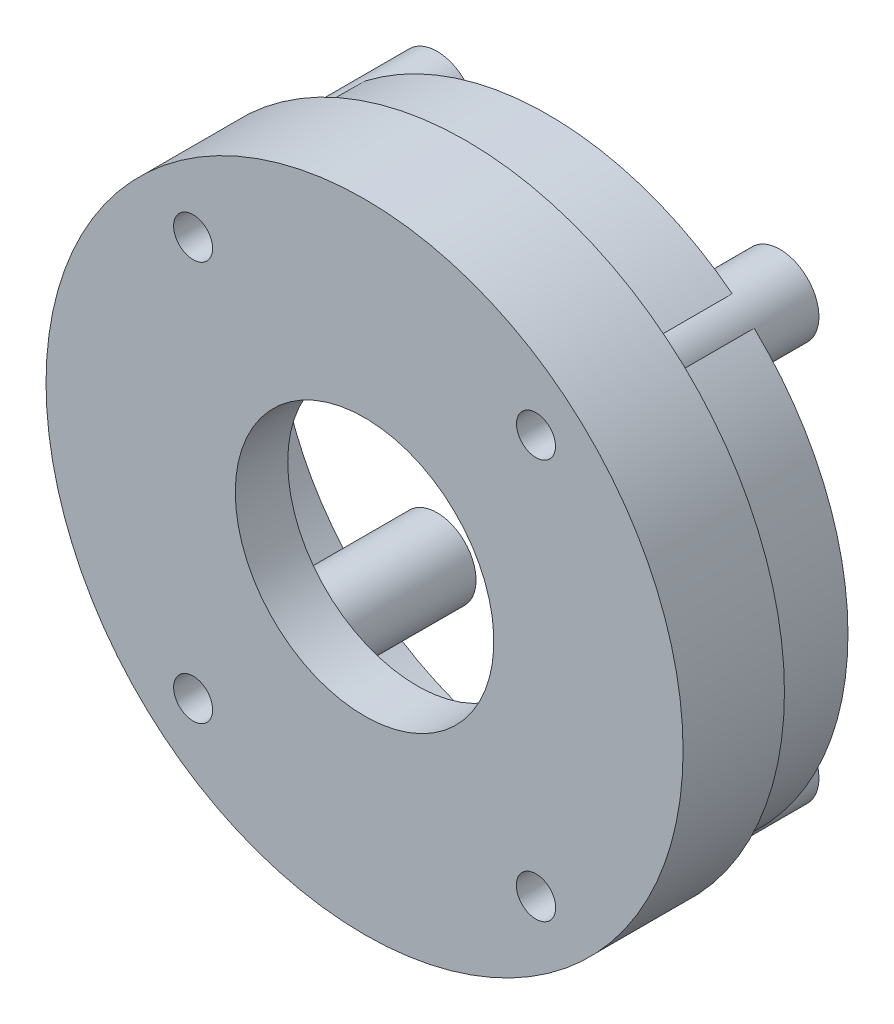
ISO-10303-21;
HEADER;
FILE_DESCRIPTION(('STEP AP214'),'2;1');
FILE_NAME('part.step','',(''),(''),'','','');
FILE_SCHEMA(('AUTOMOTIVE_DESIGN { 1 0 10303 214 1 1 1 1 }'));
ENDSEC;
DATA;
#1=APPLICATION_CONTEXT('core data for automotive mechanical design processes');
#2=APPLICATION_PROTOCOL_DEFINITION('international standard','automotive_design',2000,#1);
#3=PRODUCT_CONTEXT('',#1,'mechanical');
#4=PRODUCT('Part','Part','',(#3));
#5=PRODUCT_RELATED_PRODUCT_CATEGORY('part','',(#4));
#6=PRODUCT_DEFINITION_FORMATION('','',#4);
#7=PRODUCT_DEFINITION_CONTEXT('part definition',#1,'design');
#8=PRODUCT_DEFINITION('design','',#6,#7);
#9=PRODUCT_DEFINITION_SHAPE('','',#8);
#10=(LENGTH_UNIT() NAMED_UNIT(*) SI_UNIT(.MILLI.,.METRE.));
#11=(NAMED_UNIT(*) PLANE_ANGLE_UNIT() SI_UNIT($,.RADIAN.));
#12=(NAMED_UNIT(*) SI_UNIT($,.STERADIAN.) SOLID_ANGLE_UNIT());
#13=UNCERTAINTY_MEASURE_WITH_UNIT(LENGTH_MEASURE(1.E-05),#10,'distance_accuracy_value','');
#14=(GEOMETRIC_REPRESENTATION_CONTEXT(3) GLOBAL_UNCERTAINTY_ASSIGNED_CONTEXT((#13)) GLOBAL_UNIT_ASSIGNED_CONTEXT((#10,
#11,#12)) REPRESENTATION_CONTEXT('',''));
#15=CARTESIAN_POINT('',(0.,0.,0.));
#16=DIRECTION('',(0.,0.,1.));
#17=DIRECTION('',(1.,0.,0.));
#18=AXIS2_PLACEMENT_3D('',#15,#16,#17);
#19=CARTESIAN_POINT('',(0.,0.,-2.705));
#20=DIRECTION('',(0.,0.,1.));
#21=DIRECTION('',(1.,0.,0.));
#22=AXIS2_PLACEMENT_3D('',#19,#20,#21);
#23=PLANE('',#22);
#24=CARTESIAN_POINT('',(0.,0.,-2.705));
#25=DIRECTION('',(0.,0.,1.));
#26=DIRECTION('',(1.,0.,0.));
#27=AXIS2_PLACEMENT_3D('',#24,#25,#26);
#28=CIRCLE('',#27,17.);
#29=CARTESIAN_POINT('',(17.,0.,-2.705));
#30=VERTEX_POINT('',#29);
#31=EDGE_CURVE('E42',#30,#30,#28,.T.);
#32=ORIENTED_EDGE('',*,*,#31,.F.);
#33=EDGE_LOOP('',(#32));
#34=FACE_BOUND('',#33,.T.);
#35=CARTESIAN_POINT('',(9.15,-10.6620823482095,-2.705));
#36=DIRECTION('',(0.,0.,-1.));
#37=DIRECTION('',(-1.,0.,0.));
#38=AXIS2_PLACEMENT_3D('',#35,#36,#37);
#39=CIRCLE('',#38,2.08);
#40=CARTESIAN_POINT('',(10.9937701449825,-11.6248448591494,-2.705));
#41=VERTEX_POINT('',#40);
#42=CARTESIAN_POINT('',(9.82180369526779,-12.6306045845646,-2.705));
#43=VERTEX_POINT('',#42);
#44=EDGE_CURVE('E147',#41,#43,#39,.T.);
#45=ORIENTED_EDGE('',*,*,#44,.F.);
#46=CARTESIAN_POINT('',(0.,0.,-2.705));
#47=DIRECTION('',(0.,0.,-1.));
#48=DIRECTION('',(-1.,0.,0.));
#49=AXIS2_PLACEMENT_3D('',#46,#47,#48);
#50=CIRCLE('',#49,16.);
#51=CARTESIAN_POINT('',(10.9937701449825,11.6248448591494,-2.705));
#52=VERTEX_POINT('',#51);
#53=EDGE_CURVE('E150',#52,#41,#50,.T.);
#54=ORIENTED_EDGE('',*,*,#53,.F.);
#55=CARTESIAN_POINT('',(9.15,10.6620823482095,-2.705));
#56=DIRECTION('',(0.,0.,-1.));
#57=DIRECTION('',(-1.,0.,0.));
#58=AXIS2_PLACEMENT_3D('',#55,#56,#57);
#59=CIRCLE('',#58,2.08);
#60=CARTESIAN_POINT('',(9.82180369526777,12.6306045845646,-2.705));
#61=VERTEX_POINT('',#60);
#62=EDGE_CURVE('E72',#61,#52,#59,.T.);
#63=ORIENTED_EDGE('',*,*,#62,.F.);
#64=CARTESIAN_POINT('',(0.,0.,-2.705));
#65=DIRECTION('',(0.,0.,-1.));
#66=DIRECTION('',(-1.,0.,0.));
#67=AXIS2_PLACEMENT_3D('',#64,#65,#66);
#68=CIRCLE('',#67,16.);
#69=CARTESIAN_POINT('',(-9.82180369526777,12.6306045845646,-2.705));
#70=VERTEX_POINT('',#69);
#71=EDGE_CURVE('E53',#70,#61,#68,.T.);
#72=ORIENTED_EDGE('',*,*,#71,.F.);
#73=CARTESIAN_POINT('',(-9.15,10.6620823482095,-2.705));
#74=DIRECTION('',(0.,0.,-1.));
#75=DIRECTION('',(-1.,0.,0.));
#76=AXIS2_PLACEMENT_3D('',#73,#74,#75);
#77=CIRCLE('',#76,2.08);
#78=CARTESIAN_POINT('',(-10.9937701449825,11.6248448591494,-2.705));
#79=VERTEX_POINT('',#78);
#80=EDGE_CURVE('E466',#79,#70,#77,.T.);
#81=ORIENTED_EDGE('',*,*,#80,.F.);
#82=CARTESIAN_POINT('',(0.,0.,-2.705));
#83=DIRECTION('',(0.,0.,-1.));
#84=DIRECTION('',(-1.,0.,0.));
#85=AXIS2_PLACEMENT_3D('',#82,#83,#84);
#86=CIRCLE('',#85,16.);
#87=CARTESIAN_POINT('',(-10.9937701449825,-11.6248448591494,-2.705));
#88=VERTEX_POINT('',#87);
#89=EDGE_CURVE('E239',#88,#79,#86,.T.);
#90=ORIENTED_EDGE('',*,*,#89,.F.);
#91=CARTESIAN_POINT('',(-9.15,-10.6620823482095,-2.705));
#92=DIRECTION('',(0.,0.,-1.));
#93=DIRECTION('',(-1.,0.,0.));
#94=AXIS2_PLACEMENT_3D('',#91,#92,#93);
#95=CIRCLE('',#94,2.08);
#96=CARTESIAN_POINT('',(-9.82180369526779,-12.6306045845646,-2.705));
#97=VERTEX_POINT('',#96);
#98=EDGE_CURVE('E461',#97,#88,#95,.T.);
#99=ORIENTED_EDGE('',*,*,#98,.F.);
#100=CARTESIAN_POINT('',(0.,0.,-2.705));
#101=DIRECTION('',(0.,0.,-1.));
#102=DIRECTION('',(-1.,0.,0.));
#103=AXIS2_PLACEMENT_3D('',#100,#101,#102);
#104=CIRCLE('',#103,16.);
#105=EDGE_CURVE('E152',#43,#97,#104,.T.);
#106=ORIENTED_EDGE('',*,*,#105,.F.);
#107=EDGE_LOOP('',(#45,#54,#63,#72,#81,#90,#99,#106));
#108=FACE_BOUND('',#107,.T.);
#109=ADVANCED_FACE('F38',(#34,#108),#23,.F.);
#110=CARTESIAN_POINT('',(0.,0.,2.705));
#111=DIRECTION('',(0.,0.,-1.));
#112=DIRECTION('',(-1.,0.,0.));
#113=AXIS2_PLACEMENT_3D('',#110,#111,#112);
#114=CYLINDRICAL_SURFACE('',#113,6.9);
#115=CARTESIAN_POINT('',(0.,0.,2.705));
#116=DIRECTION('',(0.,0.,-1.));
#117=DIRECTION('',(-1.,0.,0.));
#118=AXIS2_PLACEMENT_3D('',#115,#116,#117);
#119=CIRCLE('',#118,6.9);
#120=CARTESIAN_POINT('',(-6.9,0.,2.705));
#121=VERTEX_POINT('',#120);
#122=EDGE_CURVE('E231',#121,#121,#119,.T.);
#123=ORIENTED_EDGE('',*,*,#122,.F.);
#124=EDGE_LOOP('',(#123));
#125=FACE_BOUND('',#124,.T.);
#126=CARTESIAN_POINT('',(0.,0.,-0.095));
#127=DIRECTION('',(0.,0.,-1.));
#128=DIRECTION('',(-1.,0.,0.));
#129=AXIS2_PLACEMENT_3D('',#126,#127,#128);
#130=CIRCLE('',#129,6.9);
#131=CARTESIAN_POINT('',(-6.9,0.,-0.095));
#132=VERTEX_POINT('',#131);
#133=EDGE_CURVE('E497',#132,#132,#130,.T.);
#134=ORIENTED_EDGE('',*,*,#133,.T.);
#135=EDGE_LOOP('',(#134));
#136=FACE_BOUND('',#135,.T.);
#137=ADVANCED_FACE('F142',(#125,#136),#114,.F.);
#138=CARTESIAN_POINT('',(0.,0.,1.405));
#139=DIRECTION('',(0.,0.,-1.));
#140=DIRECTION('',(-1.,0.,0.));
#141=AXIS2_PLACEMENT_3D('',#138,#139,#140);
#142=CYLINDRICAL_SURFACE('',#141,8.14);
#143=CARTESIAN_POINT('',(0.,0.,1.405));
#144=DIRECTION('',(0.,0.,-1.));
#145=DIRECTION('',(-1.,0.,0.));
#146=AXIS2_PLACEMENT_3D('',#143,#144,#145);
#147=CIRCLE('',#146,8.14);
#148=CARTESIAN_POINT('',(-8.14,0.,1.405));
#149=VERTEX_POINT('',#148);
#150=EDGE_CURVE('E228',#149,#149,#147,.T.);
#151=ORIENTED_EDGE('',*,*,#150,.T.);
#152=EDGE_LOOP('',(#151));
#153=FACE_BOUND('',#152,.T.);
#154=CARTESIAN_POINT('',(0.,0.,-0.095));
#155=DIRECTION('',(0.,0.,-1.));
#156=DIRECTION('',(-1.,0.,0.));
#157=AXIS2_PLACEMENT_3D('',#154,#155,#156);
#158=CIRCLE('',#157,8.14);
#159=CARTESIAN_POINT('',(-8.14,0.,-0.095));
#160=VERTEX_POINT('',#159);
#161=EDGE_CURVE('E222',#160,#160,#158,.T.);
#162=ORIENTED_EDGE('',*,*,#161,.F.);
#163=EDGE_LOOP('',(#162));
#164=FACE_BOUND('',#163,.T.);
#165=ADVANCED_FACE('F560',(#153,#164),#142,.T.);
#166=CARTESIAN_POINT('',(0.,0.,2.705));
#167=DIRECTION('',(0.,0.,-1.));
#168=DIRECTION('',(-1.,0.,0.));
#169=AXIS2_PLACEMENT_3D('',#166,#167,#168);
#170=CYLINDRICAL_SURFACE('',#169,17.);
#171=CARTESIAN_POINT('',(0.,0.,2.705));
#172=DIRECTION('',(0.,0.,1.));
#173=DIRECTION('',(1.,0.,0.));
#174=AXIS2_PLACEMENT_3D('',#171,#172,#173);
#175=CIRCLE('',#174,17.);
#176=CARTESIAN_POINT('',(17.,0.,2.705));
#177=VERTEX_POINT('',#176);
#178=EDGE_CURVE('E11',#177,#177,#175,.T.);
#179=ORIENTED_EDGE('',*,*,#178,.F.);
#180=EDGE_LOOP('',(#179));
#181=FACE_BOUND('',#180,.T.);
#182=ORIENTED_EDGE('',*,*,#31,.T.);
#183=EDGE_LOOP('',(#182));
#184=FACE_BOUND('',#183,.T.);
#185=ADVANCED_FACE('F40',(#181,#184),#170,.T.);
#186=CARTESIAN_POINT('',(0.,0.,2.705));
#187=DIRECTION('',(0.,0.,1.));
#188=DIRECTION('',(1.,0.,0.));
#189=AXIS2_PLACEMENT_3D('',#186,#187,#188);
#190=PLANE('',#189);
#191=CARTESIAN_POINT('',(9.15,10.6620823482095,2.705));
#192=DIRECTION('',(0.,0.,-1.));
#193=DIRECTION('',(-1.,0.,0.));
#194=AXIS2_PLACEMENT_3D('',#191,#192,#193);
#195=CIRCLE('',#194,1.04);
#196=CARTESIAN_POINT('',(8.11,10.6620823482095,2.705));
#197=VERTEX_POINT('',#196);
#198=EDGE_CURVE('E484',#197,#197,#195,.T.);
#199=ORIENTED_EDGE('',*,*,#198,.T.);
#200=EDGE_LOOP('',(#199));
#201=FACE_BOUND('',#200,.T.);
#202=CARTESIAN_POINT('',(-9.15,10.6620823482095,2.705));
#203=DIRECTION('',(0.,0.,-1.));
#204=DIRECTION('',(-1.,0.,0.));
#205=AXIS2_PLACEMENT_3D('',#202,#203,#204);
#206=CIRCLE('',#205,1.04);
#207=CARTESIAN_POINT('',(-10.19,10.6620823482095,2.705));
#208=VERTEX_POINT('',#207);
#209=EDGE_CURVE('E490',#208,#208,#206,.T.);
#210=ORIENTED_EDGE('',*,*,#209,.T.);
#211=EDGE_LOOP('',(#210));
#212=FACE_BOUND('',#211,.T.);
#213=CARTESIAN_POINT('',(-9.15,-10.6620823482095,2.705));
#214=DIRECTION('',(0.,0.,-1.));
#215=DIRECTION('',(-1.,0.,0.));
#216=AXIS2_PLACEMENT_3D('',#213,#214,#215);
#217=CIRCLE('',#216,1.04);
#218=CARTESIAN_POINT('',(-10.19,-10.6620823482095,2.705));
#219=VERTEX_POINT('',#218);
#220=EDGE_CURVE('E486',#219,#219,#217,.T.);
#221=ORIENTED_EDGE('',*,*,#220,.T.);
#222=EDGE_LOOP('',(#221));
#223=FACE_BOUND('',#222,.T.);
#224=CARTESIAN_POINT('',(9.15,-10.6620823482095,2.705));
#225=DIRECTION('',(0.,0.,-1.));
#226=DIRECTION('',(-1.,0.,0.));
#227=AXIS2_PLACEMENT_3D('',#224,#225,#226);
#228=CIRCLE('',#227,1.04899770842366);
#229=CARTESIAN_POINT('',(8.10100229157634,-10.6620823482095,2.705));
#230=VERTEX_POINT('',#229);
#231=EDGE_CURVE('E489',#230,#230,#228,.T.);
#232=ORIENTED_EDGE('',*,*,#231,.T.);
#233=EDGE_LOOP('',(#232));
#234=FACE_BOUND('',#233,.T.);
#235=ORIENTED_EDGE('',*,*,#122,.T.);
#236=EDGE_LOOP('',(#235));
#237=FACE_BOUND('',#236,.T.);
#238=ORIENTED_EDGE('',*,*,#178,.T.);
#239=EDGE_LOOP('',(#238));
#240=FACE_BOUND('',#239,.T.);
#241=ADVANCED_FACE('F554',(#201,#212,#223,#234,#237,#240),#190,.T.);
#242=CARTESIAN_POINT('',(0.,0.,-7.095));
#243=DIRECTION('',(0.,0.,1.));
#244=DIRECTION('',(1.,0.,0.));
#245=AXIS2_PLACEMENT_3D('',#242,#243,#244);
#246=CYLINDRICAL_SURFACE('',#245,14.5);
#247=DIRECTION('',(0.,0.,1.));
#248=VECTOR('',#247,1.);
#249=CARTESIAN_POINT('',(7.7859061421898,12.2323205298509,-7.095));
#250=LINE('',#249,#248);
#251=CARTESIAN_POINT('',(7.7859061421898,12.2323205298509,-7.095));
#252=VERTEX_POINT('',#251);
#253=CARTESIAN_POINT('',(7.7859061421898,12.2323205298509,1.405));
#254=VERTEX_POINT('',#253);
#255=EDGE_CURVE('E113',#252,#254,#250,.T.);
#256=ORIENTED_EDGE('',*,*,#255,.T.);
#257=CARTESIAN_POINT('',(0.,0.,1.405));
#258=DIRECTION('',(0.,0.,-1.));
#259=DIRECTION('',(-1.,0.,0.));
#260=AXIS2_PLACEMENT_3D('',#257,#258,#259);
#261=CIRCLE('',#260,14.5);
#262=CARTESIAN_POINT('',(-7.7859061421898,12.2323205298509,1.405));
#263=VERTEX_POINT('',#262);
#264=EDGE_CURVE('E108',#263,#254,#261,.T.);
#265=ORIENTED_EDGE('',*,*,#264,.F.);
#266=DIRECTION('',(0.,0.,1.));
#267=VECTOR('',#266,1.);
#268=CARTESIAN_POINT('',(-7.7859061421898,12.2323205298509,-7.095));
#269=LINE('',#268,#267);
#270=CARTESIAN_POINT('',(-7.7859061421898,12.2323205298509,-7.095));
#271=VERTEX_POINT('',#270);
#272=EDGE_CURVE('E100',#271,#263,#269,.T.);
#273=ORIENTED_EDGE('',*,*,#272,.F.);
#274=CARTESIAN_POINT('',(0.,0.,-7.095));
#275=DIRECTION('',(0.,0.,-1.));
#276=DIRECTION('',(-1.,0.,0.));
#277=AXIS2_PLACEMENT_3D('',#274,#275,#276);
#278=CIRCLE('',#277,14.5);
#279=EDGE_CURVE('E104',#271,#252,#278,.T.);
#280=ORIENTED_EDGE('',*,*,#279,.T.);
#281=EDGE_LOOP('',(#256,#265,#273,#280));
#282=FACE_BOUND('',#281,.T.);
#283=ADVANCED_FACE('F103',(#282),#246,.F.);
#284=CARTESIAN_POINT('',(0.,0.,-7.095));
#285=DIRECTION('',(0.,0.,1.));
#286=DIRECTION('',(1.,0.,0.));
#287=AXIS2_PLACEMENT_3D('',#284,#285,#286);
#288=CYLINDRICAL_SURFACE('',#287,16.);
#289=ORIENTED_EDGE('',*,*,#71,.T.);
#290=DIRECTION('',(0.,0.,1.));
#291=VECTOR('',#290,1.);
#292=CARTESIAN_POINT('',(9.82180369526777,12.6306045845646,-7.095));
#293=LINE('',#292,#291);
#294=CARTESIAN_POINT('',(9.82180369526777,12.6306045845646,-7.095));
#295=VERTEX_POINT('',#294);
#296=EDGE_CURVE('E126',#295,#61,#293,.T.);
#297=ORIENTED_EDGE('',*,*,#296,.F.);
#298=CARTESIAN_POINT('',(0.,0.,-7.095));
#299=DIRECTION('',(0.,0.,-1.));
#300=DIRECTION('',(-1.,0.,0.));
#301=AXIS2_PLACEMENT_3D('',#298,#299,#300);
#302=CIRCLE('',#301,16.);
#303=CARTESIAN_POINT('',(-9.82180369526777,12.6306045845646,-7.095));
#304=VERTEX_POINT('',#303);
#305=EDGE_CURVE('E62',#304,#295,#302,.T.);
#306=ORIENTED_EDGE('',*,*,#305,.F.);
#307=DIRECTION('',(0.,0.,1.));
#308=VECTOR('',#307,1.);
#309=CARTESIAN_POINT('',(-9.82180369526777,12.6306045845646,-7.095));
#310=LINE('',#309,#308);
#311=EDGE_CURVE('E114',#304,#70,#310,.T.);
#312=ORIENTED_EDGE('',*,*,#311,.T.);
#313=EDGE_LOOP('',(#289,#297,#306,#312));
#314=FACE_BOUND('',#313,.T.);
#315=ADVANCED_FACE('F548',(#314),#288,.T.);
#316=CARTESIAN_POINT('',(0.,0.,-7.095));
#317=DIRECTION('',(0.,0.,-1.));
#318=DIRECTION('',(-1.,0.,0.));
#319=AXIS2_PLACEMENT_3D('',#316,#317,#318);
#320=PLANE('',#319);
#321=CARTESIAN_POINT('',(9.15,10.6620823482095,-7.095));
#322=DIRECTION('',(0.,0.,-1.));
#323=DIRECTION('',(-1.,0.,0.));
#324=AXIS2_PLACEMENT_3D('',#321,#322,#323);
#325=CIRCLE('',#324,2.08);
#326=EDGE_CURVE('E120',#252,#295,#325,.T.);
#327=ORIENTED_EDGE('',*,*,#326,.F.);
#328=ORIENTED_EDGE('',*,*,#279,.F.);
#329=CARTESIAN_POINT('',(-9.15,10.6620823482095,-7.095));
#330=DIRECTION('',(0.,0.,-1.));
#331=DIRECTION('',(-1.,0.,0.));
#332=AXIS2_PLACEMENT_3D('',#329,#330,#331);
#333=CIRCLE('',#332,2.08);
#334=EDGE_CURVE('E117',#304,#271,#333,.T.);
#335=ORIENTED_EDGE('',*,*,#334,.F.);
#336=ORIENTED_EDGE('',*,*,#305,.T.);
#337=EDGE_LOOP('',(#327,#328,#335,#336));
#338=FACE_BOUND('',#337,.T.);
#339=ADVANCED_FACE('F116',(#338),#320,.T.);
#340=CARTESIAN_POINT('',(0.,0.,-7.095));
#341=DIRECTION('',(0.,0.,1.));
#342=DIRECTION('',(1.,0.,0.));
#343=AXIS2_PLACEMENT_3D('',#340,#341,#342);
#344=CYLINDRICAL_SURFACE('',#343,16.);
#345=ORIENTED_EDGE('',*,*,#105,.T.);
#346=DIRECTION('',(0.,0.,1.));
#347=VECTOR('',#346,1.);
#348=CARTESIAN_POINT('',(-9.82180369526779,-12.6306045845646,-7.095));
#349=LINE('',#348,#347);
#350=CARTESIAN_POINT('',(-9.82180369526779,-12.6306045845646,-7.095));
#351=VERTEX_POINT('',#350);
#352=EDGE_CURVE('E203',#351,#97,#349,.T.);
#353=ORIENTED_EDGE('',*,*,#352,.F.);
#354=CARTESIAN_POINT('',(0.,0.,-7.095));
#355=DIRECTION('',(0.,0.,-1.));
#356=DIRECTION('',(-1.,0.,0.));
#357=AXIS2_PLACEMENT_3D('',#354,#355,#356);
#358=CIRCLE('',#357,16.);
#359=CARTESIAN_POINT('',(9.82180369526779,-12.6306045845646,-7.095));
#360=VERTEX_POINT('',#359);
#361=EDGE_CURVE('E190',#360,#351,#358,.T.);
#362=ORIENTED_EDGE('',*,*,#361,.F.);
#363=DIRECTION('',(0.,0.,1.));
#364=VECTOR('',#363,1.);
#365=CARTESIAN_POINT('',(9.82180369526779,-12.6306045845646,-7.095));
#366=LINE('',#365,#364);
#367=EDGE_CURVE('E131',#360,#43,#366,.T.);
#368=ORIENTED_EDGE('',*,*,#367,.T.);
#369=EDGE_LOOP('',(#345,#353,#362,#368));
#370=FACE_BOUND('',#369,.T.);
#371=ADVANCED_FACE('F426',(#370),#344,.T.);
#372=CARTESIAN_POINT('',(0.,0.,-7.095));
#373=DIRECTION('',(0.,0.,1.));
#374=DIRECTION('',(1.,0.,0.));
#375=AXIS2_PLACEMENT_3D('',#372,#373,#374);
#376=CYLINDRICAL_SURFACE('',#375,14.5);
#377=DIRECTION('',(0.,0.,1.));
#378=VECTOR('',#377,1.);
#379=CARTESIAN_POINT('',(-7.78590614218981,-12.2323205298509,-7.095));
#380=LINE('',#379,#378);
#381=CARTESIAN_POINT('',(-7.78590614218981,-12.2323205298509,-7.095));
#382=VERTEX_POINT('',#381);
#383=CARTESIAN_POINT('',(-7.78590614218981,-12.2323205298509,1.405));
#384=VERTEX_POINT('',#383);
#385=EDGE_CURVE('E200',#382,#384,#380,.T.);
#386=ORIENTED_EDGE('',*,*,#385,.T.);
#387=CARTESIAN_POINT('',(0.,0.,1.405));
#388=DIRECTION('',(0.,0.,-1.));
#389=DIRECTION('',(-1.,0.,0.));
#390=AXIS2_PLACEMENT_3D('',#387,#388,#389);
#391=CIRCLE('',#390,14.5);
#392=CARTESIAN_POINT('',(7.78590614218981,-12.2323205298509,1.405));
#393=VERTEX_POINT('',#392);
#394=EDGE_CURVE('E347',#393,#384,#391,.T.);
#395=ORIENTED_EDGE('',*,*,#394,.F.);
#396=DIRECTION('',(0.,0.,1.));
#397=VECTOR('',#396,1.);
#398=CARTESIAN_POINT('',(7.78590614218981,-12.2323205298509,-7.095));
#399=LINE('',#398,#397);
#400=CARTESIAN_POINT('',(7.78590614218981,-12.2323205298509,-7.095));
#401=VERTEX_POINT('',#400);
#402=EDGE_CURVE('E81',#401,#393,#399,.T.);
#403=ORIENTED_EDGE('',*,*,#402,.F.);
#404=CARTESIAN_POINT('',(0.,0.,-7.095));
#405=DIRECTION('',(0.,0.,-1.));
#406=DIRECTION('',(-1.,0.,0.));
#407=AXIS2_PLACEMENT_3D('',#404,#405,#406);
#408=CIRCLE('',#407,14.5);
#409=EDGE_CURVE('E196',#401,#382,#408,.T.);
#410=ORIENTED_EDGE('',*,*,#409,.T.);
#411=EDGE_LOOP('',(#386,#395,#403,#410));
#412=FACE_BOUND('',#411,.T.);
#413=ADVANCED_FACE('F434',(#412),#376,.F.);
#414=CARTESIAN_POINT('',(0.,0.,-7.095));
#415=DIRECTION('',(0.,0.,-1.));
#416=DIRECTION('',(-1.,0.,0.));
#417=AXIS2_PLACEMENT_3D('',#414,#415,#416);
#418=PLANE('',#417);
#419=CARTESIAN_POINT('',(9.15,-10.6620823482095,-7.095));
#420=DIRECTION('',(0.,0.,-1.));
#421=DIRECTION('',(-1.,0.,0.));
#422=AXIS2_PLACEMENT_3D('',#419,#420,#421);
#423=CIRCLE('',#422,2.08);
#424=EDGE_CURVE('E187',#360,#401,#423,.T.);
#425=ORIENTED_EDGE('',*,*,#424,.F.);
#426=ORIENTED_EDGE('',*,*,#361,.T.);
#427=CARTESIAN_POINT('',(-9.15,-10.6620823482095,-7.095));
#428=DIRECTION('',(0.,0.,-1.));
#429=DIRECTION('',(-1.,0.,0.));
#430=AXIS2_PLACEMENT_3D('',#427,#428,#429);
#431=CIRCLE('',#430,2.08);
#432=EDGE_CURVE('E193',#382,#351,#431,.T.);
#433=ORIENTED_EDGE('',*,*,#432,.F.);
#434=ORIENTED_EDGE('',*,*,#409,.F.);
#435=EDGE_LOOP('',(#425,#426,#433,#434));
#436=FACE_BOUND('',#435,.T.);
#437=ADVANCED_FACE('F424',(#436),#418,.T.);
#438=CARTESIAN_POINT('',(0.,0.,-7.095));
#439=DIRECTION('',(0.,0.,1.));
#440=DIRECTION('',(1.,0.,0.));
#441=AXIS2_PLACEMENT_3D('',#438,#439,#440);
#442=CYLINDRICAL_SURFACE('',#441,16.);
#443=ORIENTED_EDGE('',*,*,#53,.T.);
#444=DIRECTION('',(0.,0.,1.));
#445=VECTOR('',#444,1.);
#446=CARTESIAN_POINT('',(10.9937701449825,-11.6248448591494,-7.095));
#447=LINE('',#446,#445);
#448=CARTESIAN_POINT('',(10.9937701449825,-11.6248448591494,-7.095));
#449=VERTEX_POINT('',#448);
#450=EDGE_CURVE('E166',#449,#41,#447,.T.);
#451=ORIENTED_EDGE('',*,*,#450,.F.);
#452=CARTESIAN_POINT('',(0.,0.,-7.095));
#453=DIRECTION('',(0.,0.,-1.));
#454=DIRECTION('',(-1.,0.,0.));
#455=AXIS2_PLACEMENT_3D('',#452,#453,#454);
#456=CIRCLE('',#455,16.);
#457=CARTESIAN_POINT('',(10.9937701449825,11.6248448591494,-7.095));
#458=VERTEX_POINT('',#457);
#459=EDGE_CURVE('E288',#458,#449,#456,.T.);
#460=ORIENTED_EDGE('',*,*,#459,.F.);
#461=DIRECTION('',(0.,0.,1.));
#462=VECTOR('',#461,1.);
#463=CARTESIAN_POINT('',(10.9937701449825,11.6248448591494,-7.095));
#464=LINE('',#463,#462);
#465=EDGE_CURVE('E169',#458,#52,#464,.T.);
#466=ORIENTED_EDGE('',*,*,#465,.T.);
#467=EDGE_LOOP('',(#443,#451,#460,#466));
#468=FACE_BOUND('',#467,.T.);
#469=ADVANCED_FACE('F163',(#468),#442,.T.);
#470=CARTESIAN_POINT('',(0.,0.,-7.095));
#471=DIRECTION('',(0.,0.,1.));
#472=DIRECTION('',(1.,0.,0.));
#473=AXIS2_PLACEMENT_3D('',#470,#471,#472);
#474=CYLINDRICAL_SURFACE('',#473,14.5);
#475=DIRECTION('',(0.,0.,1.));
#476=VECTOR('',#475,1.);
#477=CARTESIAN_POINT('',(10.9090638556572,-9.55208489248252,-7.095));
#478=LINE('',#477,#476);
#479=CARTESIAN_POINT('',(10.9090638556572,-9.55208489248252,-7.095));
#480=VERTEX_POINT('',#479);
#481=CARTESIAN_POINT('',(10.9090638556572,-9.55208489248252,1.405));
#482=VERTEX_POINT('',#481);
#483=EDGE_CURVE('E179',#480,#482,#478,.T.);
#484=ORIENTED_EDGE('',*,*,#483,.T.);
#485=CARTESIAN_POINT('',(0.,0.,1.405));
#486=DIRECTION('',(0.,0.,-1.));
#487=DIRECTION('',(-1.,0.,0.));
#488=AXIS2_PLACEMENT_3D('',#485,#486,#487);
#489=CIRCLE('',#488,14.5);
#490=CARTESIAN_POINT('',(14.4877870981044,-0.595000000000003,1.405));
#491=VERTEX_POINT('',#490);
#492=EDGE_CURVE('E333',#491,#482,#489,.T.);
#493=ORIENTED_EDGE('',*,*,#492,.F.);
#494=DIRECTION('',(0.,0.,1.));
#495=VECTOR('',#494,1.);
#496=CARTESIAN_POINT('',(14.4877870981044,-0.595000000000003,-7.095));
#497=LINE('',#496,#495);
#498=CARTESIAN_POINT('',(14.4877870981044,-0.595000000000003,-7.095));
#499=VERTEX_POINT('',#498);
#500=EDGE_CURVE('E183',#499,#491,#497,.T.);
#501=ORIENTED_EDGE('',*,*,#500,.F.);
#502=CARTESIAN_POINT('',(0.,0.,-7.095));
#503=DIRECTION('',(0.,0.,-1.));
#504=DIRECTION('',(-1.,0.,0.));
#505=AXIS2_PLACEMENT_3D('',#502,#503,#504);
#506=CIRCLE('',#505,14.5);
#507=EDGE_CURVE('E292',#499,#480,#506,.T.);
#508=ORIENTED_EDGE('',*,*,#507,.T.);
#509=EDGE_LOOP('',(#484,#493,#501,#508));
#510=FACE_BOUND('',#509,.T.);
#511=ADVANCED_FACE('F334',(#510),#474,.F.);
#512=CARTESIAN_POINT('',(0.,-0.595000000000003,-7.095));
#513=DIRECTION('',(0.,-1.,0.));
#514=DIRECTION('',(0.,0.,-1.));
#515=AXIS2_PLACEMENT_3D('',#512,#513,#514);
#516=PLANE('',#515);
#517=ORIENTED_EDGE('',*,*,#500,.T.);
#518=DIRECTION('',(1.,0.,0.));
#519=VECTOR('',#518,1.);
#520=CARTESIAN_POINT('',(0.,-0.595000000000003,1.405));
#521=LINE('',#520,#519);
#522=CARTESIAN_POINT('',(12.1,-0.595000000000003,1.405));
#523=VERTEX_POINT('',#522);
#524=EDGE_CURVE('E324',#523,#491,#521,.T.);
#525=ORIENTED_EDGE('',*,*,#524,.F.);
#526=DIRECTION('',(0.,0.,1.));
#527=VECTOR('',#526,1.);
#528=CARTESIAN_POINT('',(12.1,-0.595000000000003,-7.095));
#529=LINE('',#528,#527);
#530=CARTESIAN_POINT('',(12.1,-0.595000000000003,-7.095));
#531=VERTEX_POINT('',#530);
#532=EDGE_CURVE('E312',#531,#523,#529,.T.);
#533=ORIENTED_EDGE('',*,*,#532,.F.);
#534=DIRECTION('',(1.,0.,0.));
#535=VECTOR('',#534,1.);
#536=CARTESIAN_POINT('',(0.,-0.595000000000003,-7.095));
#537=LINE('',#536,#535);
#538=EDGE_CURVE('E295',#531,#499,#537,.T.);
#539=ORIENTED_EDGE('',*,*,#538,.T.);
#540=EDGE_LOOP('',(#517,#525,#533,#539));
#541=FACE_BOUND('',#540,.T.);
#542=ADVANCED_FACE('F320',(#541),#516,.T.);
#543=CARTESIAN_POINT('',(12.1,0.,-7.095));
#544=DIRECTION('',(-1.,0.,0.));
#545=DIRECTION('',(0.,0.,1.));
#546=AXIS2_PLACEMENT_3D('',#543,#544,#545);
#547=PLANE('',#546);
#548=ORIENTED_EDGE('',*,*,#532,.T.);
#549=DIRECTION('',(0.,-1.,0.));
#550=VECTOR('',#549,1.);
#551=CARTESIAN_POINT('',(12.1,0.,1.405));
#552=LINE('',#551,#550);
#553=CARTESIAN_POINT('',(12.1,0.594999999999996,1.405));
#554=VERTEX_POINT('',#553);
#555=EDGE_CURVE('E340',#554,#523,#552,.T.);
#556=ORIENTED_EDGE('',*,*,#555,.F.);
#557=DIRECTION('',(0.,0.,1.));
#558=VECTOR('',#557,1.);
#559=CARTESIAN_POINT('',(12.1,0.594999999999996,-7.095));
#560=LINE('',#559,#558);
#561=CARTESIAN_POINT('',(12.1,0.594999999999996,-7.095));
#562=VERTEX_POINT('',#561);
#563=EDGE_CURVE('E309',#562,#554,#560,.T.);
#564=ORIENTED_EDGE('',*,*,#563,.F.);
#565=DIRECTION('',(0.,-1.,0.));
#566=VECTOR('',#565,1.);
#567=CARTESIAN_POINT('',(12.1,0.,-7.095));
#568=LINE('',#567,#566);
#569=EDGE_CURVE('E299',#562,#531,#568,.T.);
#570=ORIENTED_EDGE('',*,*,#569,.T.);
#571=EDGE_LOOP('',(#548,#556,#564,#570));
#572=FACE_BOUND('',#571,.T.);
#573=ADVANCED_FACE('F514',(#572),#547,.T.);
#574=CARTESIAN_POINT('',(0.,0.594999999999996,-7.095));
#575=DIRECTION('',(0.,1.,0.));
#576=DIRECTION('',(0.,0.,1.));
#577=AXIS2_PLACEMENT_3D('',#574,#575,#576);
#578=PLANE('',#577);
#579=ORIENTED_EDGE('',*,*,#563,.T.);
#580=DIRECTION('',(-1.,0.,0.));
#581=VECTOR('',#580,1.);
#582=CARTESIAN_POINT('',(0.,0.594999999999996,1.405));
#583=LINE('',#582,#581);
#584=CARTESIAN_POINT('',(14.4877870981044,0.594999999999996,1.405));
#585=VERTEX_POINT('',#584);
#586=EDGE_CURVE('E342',#585,#554,#583,.T.);
#587=ORIENTED_EDGE('',*,*,#586,.F.);
#588=DIRECTION('',(0.,0.,1.));
#589=VECTOR('',#588,1.);
#590=CARTESIAN_POINT('',(14.4877870981044,0.594999999999996,-7.095));
#591=LINE('',#590,#589);
#592=CARTESIAN_POINT('',(14.4877870981044,0.594999999999996,-7.095));
#593=VERTEX_POINT('',#592);
#594=EDGE_CURVE('E306',#593,#585,#591,.T.);
#595=ORIENTED_EDGE('',*,*,#594,.F.);
#596=DIRECTION('',(-1.,0.,0.));
#597=VECTOR('',#596,1.);
#598=CARTESIAN_POINT('',(0.,0.594999999999996,-7.095));
#599=LINE('',#598,#597);
#600=EDGE_CURVE('E302',#593,#562,#599,.T.);
#601=ORIENTED_EDGE('',*,*,#600,.T.);
#602=EDGE_LOOP('',(#579,#587,#595,#601));
#603=FACE_BOUND('',#602,.T.);
#604=ADVANCED_FACE('F506',(#603),#578,.T.);
#605=ORIENTED_EDGE('',*,*,#594,.T.);
#606=CARTESIAN_POINT('',(10.9090638556572,9.55208489248252,1.405));
#607=VERTEX_POINT('',#606);
#608=EDGE_CURVE('E221',#607,#585,#489,.T.);
#609=ORIENTED_EDGE('',*,*,#608,.F.);
#610=DIRECTION('',(0.,0.,1.));
#611=VECTOR('',#610,1.);
#612=CARTESIAN_POINT('',(10.9090638556572,9.55208489248252,-7.095));
#613=LINE('',#612,#611);
#614=CARTESIAN_POINT('',(10.9090638556572,9.55208489248252,-7.095));
#615=VERTEX_POINT('',#614);
#616=EDGE_CURVE('E215',#615,#607,#613,.T.);
#617=ORIENTED_EDGE('',*,*,#616,.F.);
#618=EDGE_CURVE('E296',#615,#593,#506,.T.);
#619=ORIENTED_EDGE('',*,*,#618,.T.);
#620=EDGE_LOOP('',(#605,#609,#617,#619));
#621=FACE_BOUND('',#620,.T.);
#622=ADVANCED_FACE('F520',(#621),#474,.F.);
#623=CARTESIAN_POINT('',(0.,0.,-7.095));
#624=DIRECTION('',(0.,0.,-1.));
#625=DIRECTION('',(-1.,0.,0.));
#626=AXIS2_PLACEMENT_3D('',#623,#624,#625);
#627=PLANE('',#626);
#628=CARTESIAN_POINT('',(9.15,10.6620823482095,-7.095));
#629=DIRECTION('',(0.,0.,-1.));
#630=DIRECTION('',(-1.,0.,0.));
#631=AXIS2_PLACEMENT_3D('',#628,#629,#630);
#632=CIRCLE('',#631,2.08);
#633=EDGE_CURVE('E170',#458,#615,#632,.T.);
#634=ORIENTED_EDGE('',*,*,#633,.F.);
#635=ORIENTED_EDGE('',*,*,#459,.T.);
#636=CARTESIAN_POINT('',(9.15,-10.6620823482095,-7.095));
#637=DIRECTION('',(0.,0.,-1.));
#638=DIRECTION('',(-1.,0.,0.));
#639=AXIS2_PLACEMENT_3D('',#636,#637,#638);
#640=CIRCLE('',#639,2.08);
#641=EDGE_CURVE('E178',#480,#449,#640,.T.);
#642=ORIENTED_EDGE('',*,*,#641,.F.);
#643=ORIENTED_EDGE('',*,*,#507,.F.);
#644=ORIENTED_EDGE('',*,*,#538,.F.);
#645=ORIENTED_EDGE('',*,*,#569,.F.);
#646=ORIENTED_EDGE('',*,*,#600,.F.);
#647=ORIENTED_EDGE('',*,*,#618,.F.);
#648=EDGE_LOOP('',(#634,#635,#642,#643,#644,#645,#646,#647));
#649=FACE_BOUND('',#648,.T.);
#650=ADVANCED_FACE('F518',(#649),#627,.T.);
#651=CARTESIAN_POINT('',(0.,0.,-7.095));
#652=DIRECTION('',(0.,0.,1.));
#653=DIRECTION('',(1.,0.,0.));
#654=AXIS2_PLACEMENT_3D('',#651,#652,#653);
#655=CYLINDRICAL_SURFACE('',#654,16.);
#656=ORIENTED_EDGE('',*,*,#89,.T.);
#657=DIRECTION('',(0.,0.,1.));
#658=VECTOR('',#657,1.);
#659=CARTESIAN_POINT('',(-10.9937701449825,11.6248448591494,-7.095));
#660=LINE('',#659,#658);
#661=CARTESIAN_POINT('',(-10.9937701449825,11.6248448591494,-7.095));
#662=VERTEX_POINT('',#661);
#663=EDGE_CURVE('E282',#662,#79,#660,.T.);
#664=ORIENTED_EDGE('',*,*,#663,.F.);
#665=CARTESIAN_POINT('',(0.,0.,-7.095));
#666=DIRECTION('',(0.,0.,-1.));
#667=DIRECTION('',(-1.,0.,0.));
#668=AXIS2_PLACEMENT_3D('',#665,#666,#667);
#669=CIRCLE('',#668,16.);
#670=CARTESIAN_POINT('',(-10.9937701449825,-11.6248448591494,-7.095));
#671=VERTEX_POINT('',#670);
#672=EDGE_CURVE('E243',#671,#662,#669,.T.);
#673=ORIENTED_EDGE('',*,*,#672,.F.);
#674=DIRECTION('',(0.,0.,1.));
#675=VECTOR('',#674,1.);
#676=CARTESIAN_POINT('',(-10.9937701449825,-11.6248448591494,-7.095));
#677=LINE('',#676,#675);
#678=EDGE_CURVE('E171',#671,#88,#677,.T.);
#679=ORIENTED_EDGE('',*,*,#678,.T.);
#680=EDGE_LOOP('',(#656,#664,#673,#679));
#681=FACE_BOUND('',#680,.T.);
#682=ADVANCED_FACE('F464',(#681),#655,.T.);
#683=CARTESIAN_POINT('',(0.,0.,-7.095));
#684=DIRECTION('',(0.,0.,1.));
#685=DIRECTION('',(1.,0.,0.));
#686=AXIS2_PLACEMENT_3D('',#683,#684,#685);
#687=CYLINDRICAL_SURFACE('',#686,14.5);
#688=DIRECTION('',(0.,0.,1.));
#689=VECTOR('',#688,1.);
#690=CARTESIAN_POINT('',(-10.9090638556572,9.55208489248252,-7.095));
#691=LINE('',#690,#689);
#692=CARTESIAN_POINT('',(-10.9090638556572,9.55208489248252,-7.095));
#693=VERTEX_POINT('',#692);
#694=CARTESIAN_POINT('',(-10.9090638556572,9.55208489248252,1.405));
#695=VERTEX_POINT('',#694);
#696=EDGE_CURVE('E279',#693,#695,#691,.T.);
#697=ORIENTED_EDGE('',*,*,#696,.T.);
#698=CARTESIAN_POINT('',(0.,0.,1.405));
#699=DIRECTION('',(0.,0.,-1.));
#700=DIRECTION('',(-1.,0.,0.));
#701=AXIS2_PLACEMENT_3D('',#698,#699,#700);
#702=CIRCLE('',#701,14.5);
#703=CARTESIAN_POINT('',(-14.4877870981044,0.595,1.405));
#704=VERTEX_POINT('',#703);
#705=EDGE_CURVE('E233',#704,#695,#702,.T.);
#706=ORIENTED_EDGE('',*,*,#705,.F.);
#707=DIRECTION('',(0.,0.,1.));
#708=VECTOR('',#707,1.);
#709=CARTESIAN_POINT('',(-14.4877870981044,0.595,-7.095));
#710=LINE('',#709,#708);
#711=CARTESIAN_POINT('',(-14.4877870981044,0.595,-7.095));
#712=VERTEX_POINT('',#711);
#713=EDGE_CURVE('E276',#712,#704,#710,.T.);
#714=ORIENTED_EDGE('',*,*,#713,.F.);
#715=CARTESIAN_POINT('',(0.,0.,-7.095));
#716=DIRECTION('',(0.,0.,-1.));
#717=DIRECTION('',(-1.,0.,0.));
#718=AXIS2_PLACEMENT_3D('',#715,#716,#717);
#719=CIRCLE('',#718,14.5);
#720=EDGE_CURVE('E249',#712,#693,#719,.T.);
#721=ORIENTED_EDGE('',*,*,#720,.T.);
#722=EDGE_LOOP('',(#697,#706,#714,#721));
#723=FACE_BOUND('',#722,.T.);
#724=ADVANCED_FACE('F374',(#723),#687,.F.);
#725=CARTESIAN_POINT('',(0.,0.595,-7.095));
#726=DIRECTION('',(0.,-1.,0.));
#727=DIRECTION('',(0.,0.,-1.));
#728=AXIS2_PLACEMENT_3D('',#725,#726,#727);
#729=PLANE('',#728);
#730=ORIENTED_EDGE('',*,*,#713,.T.);
#731=DIRECTION('',(1.,0.,0.));
#732=VECTOR('',#731,1.);
#733=CARTESIAN_POINT('',(0.,0.595,1.405));
#734=LINE('',#733,#732);
#735=CARTESIAN_POINT('',(-12.1,0.595,1.405));
#736=VERTEX_POINT('',#735);
#737=EDGE_CURVE('E361',#704,#736,#734,.T.);
#738=ORIENTED_EDGE('',*,*,#737,.T.);
#739=DIRECTION('',(0.,0.,1.));
#740=VECTOR('',#739,1.);
#741=CARTESIAN_POINT('',(-12.1,0.595,-7.095));
#742=LINE('',#741,#740);
#743=CARTESIAN_POINT('',(-12.1,0.595,-7.095));
#744=VERTEX_POINT('',#743);
#745=EDGE_CURVE('E273',#744,#736,#742,.T.);
#746=ORIENTED_EDGE('',*,*,#745,.F.);
#747=DIRECTION('',(1.,0.,0.));
#748=VECTOR('',#747,1.);
#749=CARTESIAN_POINT('',(0.,0.595,-7.095));
#750=LINE('',#749,#748);
#751=EDGE_CURVE('E252',#712,#744,#750,.T.);
#752=ORIENTED_EDGE('',*,*,#751,.F.);
#753=EDGE_LOOP('',(#730,#738,#746,#752));
#754=FACE_BOUND('',#753,.T.);
#755=ADVANCED_FACE('F609',(#754),#729,.F.);
#756=CARTESIAN_POINT('',(-12.1,0.,-7.095));
#757=DIRECTION('',(-1.,0.,0.));
#758=DIRECTION('',(0.,0.,1.));
#759=AXIS2_PLACEMENT_3D('',#756,#757,#758);
#760=PLANE('',#759);
#761=ORIENTED_EDGE('',*,*,#745,.T.);
#762=DIRECTION('',(0.,-1.,0.));
#763=VECTOR('',#762,1.);
#764=CARTESIAN_POINT('',(-12.1,0.,1.405));
#765=LINE('',#764,#763);
#766=CARTESIAN_POINT('',(-12.1,-0.595,1.405));
#767=VERTEX_POINT('',#766);
#768=EDGE_CURVE('E359',#736,#767,#765,.T.);
#769=ORIENTED_EDGE('',*,*,#768,.T.);
#770=DIRECTION('',(0.,0.,1.));
#771=VECTOR('',#770,1.);
#772=CARTESIAN_POINT('',(-12.1,-0.595,-7.095));
#773=LINE('',#772,#771);
#774=CARTESIAN_POINT('',(-12.1,-0.595,-7.095));
#775=VERTEX_POINT('',#774);
#776=EDGE_CURVE('E270',#775,#767,#773,.T.);
#777=ORIENTED_EDGE('',*,*,#776,.F.);
#778=DIRECTION('',(0.,-1.,0.));
#779=VECTOR('',#778,1.);
#780=CARTESIAN_POINT('',(-12.1,0.,-7.095));
#781=LINE('',#780,#779);
#782=EDGE_CURVE('E256',#744,#775,#781,.T.);
#783=ORIENTED_EDGE('',*,*,#782,.F.);
#784=EDGE_LOOP('',(#761,#769,#777,#783));
#785=FACE_BOUND('',#784,.T.);
#786=ADVANCED_FACE('F451',(#785),#760,.F.);
#787=CARTESIAN_POINT('',(0.,-0.595,-7.095));
#788=DIRECTION('',(0.,1.,0.));
#789=DIRECTION('',(0.,0.,1.));
#790=AXIS2_PLACEMENT_3D('',#787,#788,#789);
#791=PLANE('',#790);
#792=ORIENTED_EDGE('',*,*,#776,.T.);
#793=DIRECTION('',(-1.,0.,0.));
#794=VECTOR('',#793,1.);
#795=CARTESIAN_POINT('',(0.,-0.595,1.405));
#796=LINE('',#795,#794);
#797=CARTESIAN_POINT('',(-14.4877870981044,-0.595,1.405));
#798=VERTEX_POINT('',#797);
#799=EDGE_CURVE('E356',#767,#798,#796,.T.);
#800=ORIENTED_EDGE('',*,*,#799,.T.);
#801=DIRECTION('',(0.,0.,1.));
#802=VECTOR('',#801,1.);
#803=CARTESIAN_POINT('',(-14.4877870981044,-0.595,-7.095));
#804=LINE('',#803,#802);
#805=CARTESIAN_POINT('',(-14.4877870981044,-0.595,-7.095));
#806=VERTEX_POINT('',#805);
#807=EDGE_CURVE('E267',#806,#798,#804,.T.);
#808=ORIENTED_EDGE('',*,*,#807,.F.);
#809=DIRECTION('',(-1.,0.,0.));
#810=VECTOR('',#809,1.);
#811=CARTESIAN_POINT('',(0.,-0.595,-7.095));
#812=LINE('',#811,#810);
#813=EDGE_CURVE('E259',#775,#806,#812,.T.);
#814=ORIENTED_EDGE('',*,*,#813,.F.);
#815=EDGE_LOOP('',(#792,#800,#808,#814));
#816=FACE_BOUND('',#815,.T.);
#817=ADVANCED_FACE('F446',(#816),#791,.F.);
#818=ORIENTED_EDGE('',*,*,#807,.T.);
#819=CARTESIAN_POINT('',(-10.9090638556572,-9.55208489248252,1.405));
#820=VERTEX_POINT('',#819);
#821=EDGE_CURVE('E353',#820,#798,#702,.T.);
#822=ORIENTED_EDGE('',*,*,#821,.F.);
#823=DIRECTION('',(0.,0.,1.));
#824=VECTOR('',#823,1.);
#825=CARTESIAN_POINT('',(-10.9090638556572,-9.55208489248252,-7.095));
#826=LINE('',#825,#824);
#827=CARTESIAN_POINT('',(-10.9090638556572,-9.55208489248252,-7.095));
#828=VERTEX_POINT('',#827);
#829=EDGE_CURVE('E264',#828,#820,#826,.T.);
#830=ORIENTED_EDGE('',*,*,#829,.F.);
#831=EDGE_CURVE('E253',#828,#806,#719,.T.);
#832=ORIENTED_EDGE('',*,*,#831,.T.);
#833=EDGE_LOOP('',(#818,#822,#830,#832));
#834=FACE_BOUND('',#833,.T.);
#835=ADVANCED_FACE('F454',(#834),#687,.F.);
#836=CARTESIAN_POINT('',(0.,0.,-7.095));
#837=DIRECTION('',(0.,0.,-1.));
#838=DIRECTION('',(-1.,0.,0.));
#839=AXIS2_PLACEMENT_3D('',#836,#837,#838);
#840=PLANE('',#839);
#841=CARTESIAN_POINT('',(-9.15,-10.6620823482095,-7.095));
#842=DIRECTION('',(0.,0.,-1.));
#843=DIRECTION('',(-1.,0.,0.));
#844=AXIS2_PLACEMENT_3D('',#841,#842,#843);
#845=CIRCLE('',#844,2.08);
#846=EDGE_CURVE('E240',#671,#828,#845,.T.);
#847=ORIENTED_EDGE('',*,*,#846,.F.);
#848=ORIENTED_EDGE('',*,*,#672,.T.);
#849=CARTESIAN_POINT('',(-9.15,10.6620823482095,-7.095));
#850=DIRECTION('',(0.,0.,-1.));
#851=DIRECTION('',(-1.,0.,0.));
#852=AXIS2_PLACEMENT_3D('',#849,#850,#851);
#853=CIRCLE('',#852,2.08);
#854=EDGE_CURVE('E246',#693,#662,#853,.T.);
#855=ORIENTED_EDGE('',*,*,#854,.F.);
#856=ORIENTED_EDGE('',*,*,#720,.F.);
#857=ORIENTED_EDGE('',*,*,#751,.T.);
#858=ORIENTED_EDGE('',*,*,#782,.T.);
#859=ORIENTED_EDGE('',*,*,#813,.T.);
#860=ORIENTED_EDGE('',*,*,#831,.F.);
#861=EDGE_LOOP('',(#847,#848,#855,#856,#857,#858,#859,#860));
#862=FACE_BOUND('',#861,.T.);
#863=ADVANCED_FACE('F459',(#862),#840,.T.);
#864=CARTESIAN_POINT('',(9.15,10.6620823482095,1.405));
#865=DIRECTION('',(0.,0.,-1.));
#866=DIRECTION('',(-1.,0.,0.));
#867=AXIS2_PLACEMENT_3D('',#864,#865,#866);
#868=CYLINDRICAL_SURFACE('',#867,2.08);
#869=CARTESIAN_POINT('',(9.15,10.6620823482095,1.405));
#870=DIRECTION('',(0.,0.,-1.));
#871=DIRECTION('',(-1.,0.,0.));
#872=AXIS2_PLACEMENT_3D('',#869,#870,#871);
#873=CIRCLE('',#872,2.08);
#874=EDGE_CURVE('E211',#607,#254,#873,.T.);
#875=ORIENTED_EDGE('',*,*,#874,.T.);
#876=ORIENTED_EDGE('',*,*,#255,.F.);
#877=ORIENTED_EDGE('',*,*,#326,.T.);
#878=ORIENTED_EDGE('',*,*,#296,.T.);
#879=ORIENTED_EDGE('',*,*,#62,.T.);
#880=ORIENTED_EDGE('',*,*,#465,.F.);
#881=ORIENTED_EDGE('',*,*,#633,.T.);
#882=ORIENTED_EDGE('',*,*,#616,.T.);
#883=EDGE_LOOP('',(#875,#876,#877,#878,#879,#880,#881,#882));
#884=FACE_BOUND('',#883,.T.);
#885=CARTESIAN_POINT('',(9.15,10.6620823482095,-10.315));
#886=DIRECTION('',(0.,0.,-1.));
#887=DIRECTION('',(-1.,0.,0.));
#888=AXIS2_PLACEMENT_3D('',#885,#886,#887);
#889=CIRCLE('',#888,2.08);
#890=CARTESIAN_POINT('',(7.07,10.6620823482095,-10.315));
#891=VERTEX_POINT('',#890);
#892=EDGE_CURVE('E481',#891,#891,#889,.T.);
#893=ORIENTED_EDGE('',*,*,#892,.F.);
#894=EDGE_LOOP('',(#893));
#895=FACE_BOUND('',#894,.T.);
#896=ADVANCED_FACE('F207',(#884,#895),#868,.T.);
#897=CARTESIAN_POINT('',(-9.15,10.6620823482095,1.405));
#898=DIRECTION('',(0.,0.,-1.));
#899=DIRECTION('',(-1.,0.,0.));
#900=AXIS2_PLACEMENT_3D('',#897,#898,#899);
#901=CYLINDRICAL_SURFACE('',#900,2.08);
#902=CARTESIAN_POINT('',(-9.15,10.6620823482095,1.405));
#903=DIRECTION('',(0.,0.,-1.));
#904=DIRECTION('',(-1.,0.,0.));
#905=AXIS2_PLACEMENT_3D('',#902,#903,#904);
#906=CIRCLE('',#905,2.08);
#907=EDGE_CURVE('E227',#263,#695,#906,.T.);
#908=ORIENTED_EDGE('',*,*,#907,.T.);
#909=ORIENTED_EDGE('',*,*,#696,.F.);
#910=ORIENTED_EDGE('',*,*,#854,.T.);
#911=ORIENTED_EDGE('',*,*,#663,.T.);
#912=ORIENTED_EDGE('',*,*,#80,.T.);
#913=ORIENTED_EDGE('',*,*,#311,.F.);
#914=ORIENTED_EDGE('',*,*,#334,.T.);
#915=ORIENTED_EDGE('',*,*,#272,.T.);
#916=EDGE_LOOP('',(#908,#909,#910,#911,#912,#913,#914,#915));
#917=FACE_BOUND('',#916,.T.);
#918=CARTESIAN_POINT('',(-9.15,10.6620823482095,-10.315));
#919=DIRECTION('',(0.,0.,-1.));
#920=DIRECTION('',(-1.,0.,0.));
#921=AXIS2_PLACEMENT_3D('',#918,#919,#920);
#922=CIRCLE('',#921,2.08);
#923=CARTESIAN_POINT('',(-11.23,10.6620823482095,-10.315));
#924=VERTEX_POINT('',#923);
#925=EDGE_CURVE('E471',#924,#924,#922,.T.);
#926=ORIENTED_EDGE('',*,*,#925,.F.);
#927=EDGE_LOOP('',(#926));
#928=FACE_BOUND('',#927,.T.);
#929=ADVANCED_FACE('F122',(#917,#928),#901,.T.);
#930=CARTESIAN_POINT('',(-9.15,-10.6620823482095,1.405));
#931=DIRECTION('',(0.,0.,-1.));
#932=DIRECTION('',(-1.,0.,0.));
#933=AXIS2_PLACEMENT_3D('',#930,#931,#932);
#934=CYLINDRICAL_SURFACE('',#933,2.08);
#935=CARTESIAN_POINT('',(-9.15,-10.6620823482095,1.405));
#936=DIRECTION('',(0.,0.,-1.));
#937=DIRECTION('',(-1.,0.,0.));
#938=AXIS2_PLACEMENT_3D('',#935,#936,#937);
#939=CIRCLE('',#938,2.08);
#940=EDGE_CURVE('E350',#820,#384,#939,.T.);
#941=ORIENTED_EDGE('',*,*,#940,.T.);
#942=ORIENTED_EDGE('',*,*,#385,.F.);
#943=ORIENTED_EDGE('',*,*,#432,.T.);
#944=ORIENTED_EDGE('',*,*,#352,.T.);
#945=ORIENTED_EDGE('',*,*,#98,.T.);
#946=ORIENTED_EDGE('',*,*,#678,.F.);
#947=ORIENTED_EDGE('',*,*,#846,.T.);
#948=ORIENTED_EDGE('',*,*,#829,.T.);
#949=EDGE_LOOP('',(#941,#942,#943,#944,#945,#946,#947,#948));
#950=FACE_BOUND('',#949,.T.);
#951=CARTESIAN_POINT('',(-9.15,-10.6620823482095,-10.315));
#952=DIRECTION('',(0.,0.,-1.));
#953=DIRECTION('',(-1.,0.,0.));
#954=AXIS2_PLACEMENT_3D('',#951,#952,#953);
#955=CIRCLE('',#954,2.08);
#956=CARTESIAN_POINT('',(-11.23,-10.6620823482095,-10.315));
#957=VERTEX_POINT('',#956);
#958=EDGE_CURVE('E468',#957,#957,#955,.T.);
#959=ORIENTED_EDGE('',*,*,#958,.F.);
#960=EDGE_LOOP('',(#959));
#961=FACE_BOUND('',#960,.T.);
#962=ADVANCED_FACE('F430',(#950,#961),#934,.T.);
#963=CARTESIAN_POINT('',(9.15,-10.6620823482095,1.405));
#964=DIRECTION('',(0.,0.,-1.));
#965=DIRECTION('',(-1.,0.,0.));
#966=AXIS2_PLACEMENT_3D('',#963,#964,#965);
#967=CYLINDRICAL_SURFACE('',#966,2.08);
#968=CARTESIAN_POINT('',(9.15,-10.6620823482095,1.405));
#969=DIRECTION('',(0.,0.,-1.));
#970=DIRECTION('',(-1.,0.,0.));
#971=AXIS2_PLACEMENT_3D('',#968,#969,#970);
#972=CIRCLE('',#971,2.08);
#973=EDGE_CURVE('E336',#393,#482,#972,.T.);
#974=ORIENTED_EDGE('',*,*,#973,.T.);
#975=ORIENTED_EDGE('',*,*,#483,.F.);
#976=ORIENTED_EDGE('',*,*,#641,.T.);
#977=ORIENTED_EDGE('',*,*,#450,.T.);
#978=ORIENTED_EDGE('',*,*,#44,.T.);
#979=ORIENTED_EDGE('',*,*,#367,.F.);
#980=ORIENTED_EDGE('',*,*,#424,.T.);
#981=ORIENTED_EDGE('',*,*,#402,.T.);
#982=EDGE_LOOP('',(#974,#975,#976,#977,#978,#979,#980,#981));
#983=FACE_BOUND('',#982,.T.);
#984=CARTESIAN_POINT('',(9.15,-10.6620823482095,-10.315));
#985=DIRECTION('',(0.,0.,-1.));
#986=DIRECTION('',(-1.,0.,0.));
#987=AXIS2_PLACEMENT_3D('',#984,#985,#986);
#988=CIRCLE('',#987,2.08);
#989=CARTESIAN_POINT('',(7.07,-10.6620823482095,-10.315));
#990=VERTEX_POINT('',#989);
#991=EDGE_CURVE('E949',#990,#990,#988,.T.);
#992=ORIENTED_EDGE('',*,*,#991,.F.);
#993=EDGE_LOOP('',(#992));
#994=FACE_BOUND('',#993,.T.);
#995=ADVANCED_FACE('F174',(#983,#994),#967,.T.);
#996=CARTESIAN_POINT('',(0.,0.,1.405));
#997=DIRECTION('',(0.,0.,-1.));
#998=DIRECTION('',(-1.,0.,0.));
#999=AXIS2_PLACEMENT_3D('',#996,#997,#998);
#1000=PLANE('',#999);
#1001=ORIENTED_EDGE('',*,*,#874,.F.);
#1002=ORIENTED_EDGE('',*,*,#608,.T.);
#1003=ORIENTED_EDGE('',*,*,#586,.T.);
#1004=ORIENTED_EDGE('',*,*,#555,.T.);
#1005=ORIENTED_EDGE('',*,*,#524,.T.);
#1006=ORIENTED_EDGE('',*,*,#492,.T.);
#1007=ORIENTED_EDGE('',*,*,#973,.F.);
#1008=ORIENTED_EDGE('',*,*,#394,.T.);
#1009=ORIENTED_EDGE('',*,*,#940,.F.);
#1010=ORIENTED_EDGE('',*,*,#821,.T.);
#1011=ORIENTED_EDGE('',*,*,#799,.F.);
#1012=ORIENTED_EDGE('',*,*,#768,.F.);
#1013=ORIENTED_EDGE('',*,*,#737,.F.);
#1014=ORIENTED_EDGE('',*,*,#705,.T.);
#1015=ORIENTED_EDGE('',*,*,#907,.F.);
#1016=ORIENTED_EDGE('',*,*,#264,.T.);
#1017=EDGE_LOOP('',(#1001,#1002,#1003,#1004,#1005,#1006,#1007,#1008,#1009,#1010,#1011,#1012,
#1013,#1014,#1015,#1016));
#1018=FACE_BOUND('',#1017,.T.);
#1019=ORIENTED_EDGE('',*,*,#150,.F.);
#1020=EDGE_LOOP('',(#1019));
#1021=FACE_BOUND('',#1020,.T.);
#1022=ADVANCED_FACE('F224',(#1018,#1021),#1000,.T.);
#1023=CARTESIAN_POINT('',(0.,0.,-0.095));
#1024=DIRECTION('',(0.,0.,-1.));
#1025=DIRECTION('',(-1.,0.,0.));
#1026=AXIS2_PLACEMENT_3D('',#1023,#1024,#1025);
#1027=PLANE('',#1026);
#1028=ORIENTED_EDGE('',*,*,#133,.F.);
#1029=EDGE_LOOP('',(#1028));
#1030=FACE_BOUND('',#1029,.T.);
#1031=ORIENTED_EDGE('',*,*,#161,.T.);
#1032=EDGE_LOOP('',(#1031));
#1033=FACE_BOUND('',#1032,.T.);
#1034=ADVANCED_FACE('F579',(#1030,#1033),#1027,.T.);
#1035=CARTESIAN_POINT('',(9.15,-10.6620823482095,2.705));
#1036=DIRECTION('',(0.,0.,-1.));
#1037=DIRECTION('',(-1.,0.,0.));
#1038=AXIS2_PLACEMENT_3D('',#1035,#1036,#1037);
#1039=CYLINDRICAL_SURFACE('',#1038,1.04899770842366);
#1040=ORIENTED_EDGE('',*,*,#231,.F.);
#1041=EDGE_LOOP('',(#1040));
#1042=FACE_BOUND('',#1041,.T.);
#1043=CARTESIAN_POINT('',(9.15,-10.6620823482095,-10.315));
#1044=DIRECTION('',(0.,0.,-1.));
#1045=DIRECTION('',(-1.,0.,0.));
#1046=AXIS2_PLACEMENT_3D('',#1043,#1044,#1045);
#1047=CIRCLE('',#1046,1.04899770842366);
#1048=CARTESIAN_POINT('',(8.10100229157634,-10.6620823482095,-10.315));
#1049=VERTEX_POINT('',#1048);
#1050=EDGE_CURVE('E158',#1049,#1049,#1047,.T.);
#1051=ORIENTED_EDGE('',*,*,#1050,.T.);
#1052=EDGE_LOOP('',(#1051));
#1053=FACE_BOUND('',#1052,.T.);
#1054=ADVANCED_FACE('F582',(#1042,#1053),#1039,.F.);
#1055=CARTESIAN_POINT('',(-9.15,-10.6620823482095,2.705));
#1056=DIRECTION('',(0.,0.,-1.));
#1057=DIRECTION('',(-1.,0.,0.));
#1058=AXIS2_PLACEMENT_3D('',#1055,#1056,#1057);
#1059=CYLINDRICAL_SURFACE('',#1058,1.04);
#1060=ORIENTED_EDGE('',*,*,#220,.F.);
#1061=EDGE_LOOP('',(#1060));
#1062=FACE_BOUND('',#1061,.T.);
#1063=CARTESIAN_POINT('',(-9.15,-10.6620823482095,-10.315));
#1064=DIRECTION('',(0.,0.,-1.));
#1065=DIRECTION('',(-1.,0.,0.));
#1066=AXIS2_PLACEMENT_3D('',#1063,#1064,#1065);
#1067=CIRCLE('',#1066,1.04);
#1068=CARTESIAN_POINT('',(-10.19,-10.6620823482095,-10.315));
#1069=VERTEX_POINT('',#1068);
#1070=EDGE_CURVE('E474',#1069,#1069,#1067,.T.);
#1071=ORIENTED_EDGE('',*,*,#1070,.T.);
#1072=EDGE_LOOP('',(#1071));
#1073=FACE_BOUND('',#1072,.T.);
#1074=ADVANCED_FACE('F671',(#1062,#1073),#1059,.F.);
#1075=CARTESIAN_POINT('',(-9.15,10.6620823482095,2.705));
#1076=DIRECTION('',(0.,0.,-1.));
#1077=DIRECTION('',(-1.,0.,0.));
#1078=AXIS2_PLACEMENT_3D('',#1075,#1076,#1077);
#1079=CYLINDRICAL_SURFACE('',#1078,1.04);
#1080=ORIENTED_EDGE('',*,*,#209,.F.);
#1081=EDGE_LOOP('',(#1080));
#1082=FACE_BOUND('',#1081,.T.);
#1083=CARTESIAN_POINT('',(-9.15,10.6620823482095,-10.315));
#1084=DIRECTION('',(0.,0.,-1.));
#1085=DIRECTION('',(-1.,0.,0.));
#1086=AXIS2_PLACEMENT_3D('',#1083,#1084,#1085);
#1087=CIRCLE('',#1086,1.04);
#1088=CARTESIAN_POINT('',(-10.19,10.6620823482095,-10.315));
#1089=VERTEX_POINT('',#1088);
#1090=EDGE_CURVE('E467',#1089,#1089,#1087,.T.);
#1091=ORIENTED_EDGE('',*,*,#1090,.T.);
#1092=EDGE_LOOP('',(#1091));
#1093=FACE_BOUND('',#1092,.T.);
#1094=ADVANCED_FACE('F679',(#1082,#1093),#1079,.F.);
#1095=CARTESIAN_POINT('',(9.15,10.6620823482095,2.705));
#1096=DIRECTION('',(0.,0.,-1.));
#1097=DIRECTION('',(-1.,0.,0.));
#1098=AXIS2_PLACEMENT_3D('',#1095,#1096,#1097);
#1099=CYLINDRICAL_SURFACE('',#1098,1.04);
#1100=ORIENTED_EDGE('',*,*,#198,.F.);
#1101=EDGE_LOOP('',(#1100));
#1102=FACE_BOUND('',#1101,.T.);
#1103=CARTESIAN_POINT('',(9.15,10.6620823482095,-10.315));
#1104=DIRECTION('',(0.,0.,-1.));
#1105=DIRECTION('',(-1.,0.,0.));
#1106=AXIS2_PLACEMENT_3D('',#1103,#1104,#1105);
#1107=CIRCLE('',#1106,1.04);
#1108=CARTESIAN_POINT('',(8.11,10.6620823482095,-10.315));
#1109=VERTEX_POINT('',#1108);
#1110=EDGE_CURVE('E478',#1109,#1109,#1107,.T.);
#1111=ORIENTED_EDGE('',*,*,#1110,.T.);
#1112=EDGE_LOOP('',(#1111));
#1113=FACE_BOUND('',#1112,.T.);
#1114=ADVANCED_FACE('F687',(#1102,#1113),#1099,.F.);
#1115=CARTESIAN_POINT('',(0.,0.,-10.315));
#1116=DIRECTION('',(0.,0.,-1.));
#1117=DIRECTION('',(-1.,0.,0.));
#1118=AXIS2_PLACEMENT_3D('',#1115,#1116,#1117);
#1119=PLANE('',#1118);
#1120=ORIENTED_EDGE('',*,*,#1110,.F.);
#1121=EDGE_LOOP('',(#1120));
#1122=FACE_BOUND('',#1121,.T.);
#1123=ORIENTED_EDGE('',*,*,#892,.T.);
#1124=EDGE_LOOP('',(#1123));
#1125=FACE_BOUND('',#1124,.T.);
#1126=ADVANCED_FACE('F695',(#1122,#1125),#1119,.T.);
#1127=CARTESIAN_POINT('',(0.,0.,-10.315));
#1128=DIRECTION('',(0.,0.,-1.));
#1129=DIRECTION('',(-1.,0.,0.));
#1130=AXIS2_PLACEMENT_3D('',#1127,#1128,#1129);
#1131=PLANE('',#1130);
#1132=ORIENTED_EDGE('',*,*,#1090,.F.);
#1133=EDGE_LOOP('',(#1132));
#1134=FACE_BOUND('',#1133,.T.);
#1135=ORIENTED_EDGE('',*,*,#925,.T.);
#1136=EDGE_LOOP('',(#1135));
#1137=FACE_BOUND('',#1136,.T.);
#1138=ADVANCED_FACE('F703',(#1134,#1137),#1131,.T.);
#1139=CARTESIAN_POINT('',(0.,0.,-10.315));
#1140=DIRECTION('',(0.,0.,-1.));
#1141=DIRECTION('',(-1.,0.,0.));
#1142=AXIS2_PLACEMENT_3D('',#1139,#1140,#1141);
#1143=PLANE('',#1142);
#1144=ORIENTED_EDGE('',*,*,#1070,.F.);
#1145=EDGE_LOOP('',(#1144));
#1146=FACE_BOUND('',#1145,.T.);
#1147=ORIENTED_EDGE('',*,*,#958,.T.);
#1148=EDGE_LOOP('',(#1147));
#1149=FACE_BOUND('',#1148,.T.);
#1150=ADVANCED_FACE('F711',(#1146,#1149),#1143,.T.);
#1151=CARTESIAN_POINT('',(0.,0.,-10.315));
#1152=DIRECTION('',(0.,0.,-1.));
#1153=DIRECTION('',(-1.,0.,0.));
#1154=AXIS2_PLACEMENT_3D('',#1151,#1152,#1153);
#1155=PLANE('',#1154);
#1156=ORIENTED_EDGE('',*,*,#1050,.F.);
#1157=EDGE_LOOP('',(#1156));
#1158=FACE_BOUND('',#1157,.T.);
#1159=ORIENTED_EDGE('',*,*,#991,.T.);
#1160=EDGE_LOOP('',(#1159));
#1161=FACE_BOUND('',#1160,.T.);
#1162=ADVANCED_FACE('F719',(#1158,#1161),#1155,.T.);
#1163=CLOSED_SHELL('',(#109,#137,#165,#185,#241,#283,#315,#339,#371,#413,#437,#469,#511,#542,
#573,#604,#622,#650,#682,#724,#755,#786,#817,#835,#863,#896,#929,#962,#995,#1022,#1034,#1054,
#1074,#1094,#1114,#1126,#1138,#1150,#1162));
#1164=MANIFOLD_SOLID_BREP('B2',#1163);
#1165=ADVANCED_BREP_SHAPE_REPRESENTATION('',(#18,#1164),#14);
#1166=SHAPE_DEFINITION_REPRESENTATION(#9,#1165);
ENDSEC;
END-ISO-10303-21;
